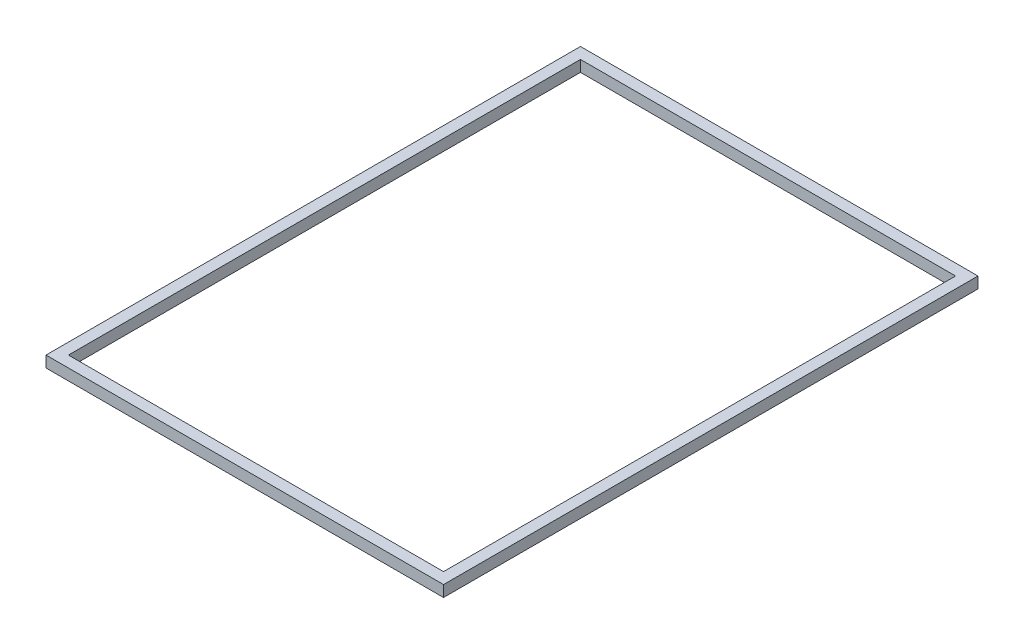
ISO-10303-21;
HEADER;
FILE_DESCRIPTION(('STEP AP214'),'2;1');
FILE_NAME('part.step','',(''),(''),'','','');
FILE_SCHEMA(('AUTOMOTIVE_DESIGN { 1 0 10303 214 1 1 1 1 }'));
ENDSEC;
DATA;
#1=APPLICATION_CONTEXT('core data for automotive mechanical design processes');
#2=APPLICATION_PROTOCOL_DEFINITION('international standard','automotive_design',2000,#1);
#3=PRODUCT_CONTEXT('',#1,'mechanical');
#4=PRODUCT('Part','Part','',(#3));
#5=PRODUCT_RELATED_PRODUCT_CATEGORY('part','',(#4));
#6=PRODUCT_DEFINITION_FORMATION('','',#4);
#7=PRODUCT_DEFINITION_CONTEXT('part definition',#1,'design');
#8=PRODUCT_DEFINITION('design','',#6,#7);
#9=PRODUCT_DEFINITION_SHAPE('','',#8);
#10=(LENGTH_UNIT() NAMED_UNIT(*) SI_UNIT(.MILLI.,.METRE.));
#11=(NAMED_UNIT(*) PLANE_ANGLE_UNIT() SI_UNIT($,.RADIAN.));
#12=(NAMED_UNIT(*) SI_UNIT($,.STERADIAN.) SOLID_ANGLE_UNIT());
#13=UNCERTAINTY_MEASURE_WITH_UNIT(LENGTH_MEASURE(1.E-05),#10,'distance_accuracy_value','');
#14=(GEOMETRIC_REPRESENTATION_CONTEXT(3) GLOBAL_UNCERTAINTY_ASSIGNED_CONTEXT((#13)) GLOBAL_UNIT_ASSIGNED_CONTEXT((#10,
#11,#12)) REPRESENTATION_CONTEXT('',''));
#15=CARTESIAN_POINT('',(0.,0.,0.));
#16=DIRECTION('',(0.,0.,1.));
#17=DIRECTION('',(1.,0.,0.));
#18=AXIS2_PLACEMENT_3D('',#15,#16,#17);
#19=CARTESIAN_POINT('',(-450.,0.,-605.));
#20=DIRECTION('',(-1.,0.,0.));
#21=DIRECTION('',(0.,0.,1.));
#22=AXIS2_PLACEMENT_3D('',#19,#20,#21);
#23=PLANE('',#22);
#24=DIRECTION('',(0.,0.,1.));
#25=VECTOR('',#24,1.);
#26=CARTESIAN_POINT('',(-450.,0.,-605.));
#27=LINE('',#26,#25);
#28=CARTESIAN_POINT('',(-450.,0.,-605.));
#29=VERTEX_POINT('',#28);
#30=CARTESIAN_POINT('',(-450.,0.,605.));
#31=VERTEX_POINT('',#30);
#32=EDGE_CURVE('E130',#29,#31,#27,.T.);
#33=ORIENTED_EDGE('',*,*,#32,.T.);
#34=DIRECTION('',(0.,-1.,0.));
#35=VECTOR('',#34,1.);
#36=CARTESIAN_POINT('',(-450.,0.,605.));
#37=LINE('',#36,#35);
#38=CARTESIAN_POINT('',(-450.,25.4,605.));
#39=VERTEX_POINT('',#38);
#40=EDGE_CURVE('E165',#39,#31,#37,.T.);
#41=ORIENTED_EDGE('',*,*,#40,.F.);
#42=DIRECTION('',(0.,0.,1.));
#43=VECTOR('',#42,1.);
#44=CARTESIAN_POINT('',(-450.,25.4,-605.));
#45=LINE('',#44,#43);
#46=CARTESIAN_POINT('',(-450.,25.4,-605.));
#47=VERTEX_POINT('',#46);
#48=EDGE_CURVE('E145',#47,#39,#45,.T.);
#49=ORIENTED_EDGE('',*,*,#48,.F.);
#50=DIRECTION('',(0.,-1.,0.));
#51=VECTOR('',#50,1.);
#52=CARTESIAN_POINT('',(-450.,0.,-605.));
#53=LINE('',#52,#51);
#54=EDGE_CURVE('E220',#47,#29,#53,.T.);
#55=ORIENTED_EDGE('',*,*,#54,.T.);
#56=EDGE_LOOP('',(#33,#41,#49,#55));
#57=FACE_BOUND('',#56,.T.);
#58=ADVANCED_FACE('F34',(#57),#23,.T.);
#59=CARTESIAN_POINT('',(-424.6,0.,-605.));
#60=DIRECTION('',(1.,0.,0.));
#61=DIRECTION('',(0.,0.,-1.));
#62=AXIS2_PLACEMENT_3D('',#59,#60,#61);
#63=PLANE('',#62);
#64=DIRECTION('',(0.,0.,1.));
#65=VECTOR('',#64,1.);
#66=CARTESIAN_POINT('',(-424.6,25.4,-605.));
#67=LINE('',#66,#65);
#68=CARTESIAN_POINT('',(-424.6,25.4,-579.6));
#69=VERTEX_POINT('',#68);
#70=CARTESIAN_POINT('',(-424.6,25.4,579.6));
#71=VERTEX_POINT('',#70);
#72=EDGE_CURVE('E38',#69,#71,#67,.T.);
#73=ORIENTED_EDGE('',*,*,#72,.T.);
#74=DIRECTION('',(0.,-1.,0.));
#75=VECTOR('',#74,1.);
#76=CARTESIAN_POINT('',(-424.6,0.,579.6));
#77=LINE('',#76,#75);
#78=CARTESIAN_POINT('',(-424.6,0.,579.6));
#79=VERTEX_POINT('',#78);
#80=EDGE_CURVE('E137',#71,#79,#77,.T.);
#81=ORIENTED_EDGE('',*,*,#80,.T.);
#82=DIRECTION('',(0.,0.,1.));
#83=VECTOR('',#82,1.);
#84=CARTESIAN_POINT('',(-424.6,0.,-605.));
#85=LINE('',#84,#83);
#86=CARTESIAN_POINT('',(-424.6,0.,-579.6));
#87=VERTEX_POINT('',#86);
#88=EDGE_CURVE('E146',#87,#79,#85,.T.);
#89=ORIENTED_EDGE('',*,*,#88,.F.);
#90=DIRECTION('',(0.,-1.,0.));
#91=VECTOR('',#90,1.);
#92=CARTESIAN_POINT('',(-424.6,0.,-579.6));
#93=LINE('',#92,#91);
#94=EDGE_CURVE('E140',#69,#87,#93,.T.);
#95=ORIENTED_EDGE('',*,*,#94,.F.);
#96=EDGE_LOOP('',(#73,#81,#89,#95));
#97=FACE_BOUND('',#96,.T.);
#98=ADVANCED_FACE('F136',(#97),#63,.T.);
#99=CARTESIAN_POINT('',(-450.,25.4,-605.));
#100=DIRECTION('',(0.,1.,0.));
#101=DIRECTION('',(0.,0.,1.));
#102=AXIS2_PLACEMENT_3D('',#99,#100,#101);
#103=PLANE('',#102);
#104=DIRECTION('',(1.,0.,0.));
#105=VECTOR('',#104,1.);
#106=CARTESIAN_POINT('',(-450.,25.4,579.6));
#107=LINE('',#106,#105);
#108=CARTESIAN_POINT('',(424.6,25.4,579.6));
#109=VERTEX_POINT('',#108);
#110=EDGE_CURVE('E150',#71,#109,#107,.T.);
#111=ORIENTED_EDGE('',*,*,#110,.F.);
#112=ORIENTED_EDGE('',*,*,#72,.F.);
#113=DIRECTION('',(-1.,0.,0.));
#114=VECTOR('',#113,1.);
#115=CARTESIAN_POINT('',(450.,25.4,-579.6));
#116=LINE('',#115,#114);
#117=CARTESIAN_POINT('',(424.6,25.4,-579.6));
#118=VERTEX_POINT('',#117);
#119=EDGE_CURVE('E179',#118,#69,#116,.T.);
#120=ORIENTED_EDGE('',*,*,#119,.F.);
#121=DIRECTION('',(0.,0.,-1.));
#122=VECTOR('',#121,1.);
#123=CARTESIAN_POINT('',(424.6,25.4,605.));
#124=LINE('',#123,#122);
#125=EDGE_CURVE('E160',#109,#118,#124,.T.);
#126=ORIENTED_EDGE('',*,*,#125,.F.);
#127=EDGE_LOOP('',(#111,#112,#120,#126));
#128=FACE_BOUND('',#127,.T.);
#129=ORIENTED_EDGE('',*,*,#48,.T.);
#130=DIRECTION('',(1.,0.,0.));
#131=VECTOR('',#130,1.);
#132=CARTESIAN_POINT('',(-450.,25.4,605.));
#133=LINE('',#132,#131);
#134=CARTESIAN_POINT('',(450.,25.4,605.));
#135=VERTEX_POINT('',#134);
#136=EDGE_CURVE('E161',#39,#135,#133,.T.);
#137=ORIENTED_EDGE('',*,*,#136,.T.);
#138=DIRECTION('',(0.,0.,-1.));
#139=VECTOR('',#138,1.);
#140=CARTESIAN_POINT('',(450.,25.4,605.));
#141=LINE('',#140,#139);
#142=CARTESIAN_POINT('',(450.,25.4,-605.));
#143=VERTEX_POINT('',#142);
#144=EDGE_CURVE('E203',#135,#143,#141,.T.);
#145=ORIENTED_EDGE('',*,*,#144,.T.);
#146=DIRECTION('',(-1.,0.,0.));
#147=VECTOR('',#146,1.);
#148=CARTESIAN_POINT('',(450.,25.4,-605.));
#149=LINE('',#148,#147);
#150=EDGE_CURVE('E186',#143,#47,#149,.T.);
#151=ORIENTED_EDGE('',*,*,#150,.T.);
#152=EDGE_LOOP('',(#129,#137,#145,#151));
#153=FACE_BOUND('',#152,.T.);
#154=ADVANCED_FACE('F157',(#128,#153),#103,.T.);
#155=CARTESIAN_POINT('',(-450.,0.,-605.));
#156=DIRECTION('',(0.,-1.,0.));
#157=DIRECTION('',(0.,0.,-1.));
#158=AXIS2_PLACEMENT_3D('',#155,#156,#157);
#159=PLANE('',#158);
#160=DIRECTION('',(1.,0.,0.));
#161=VECTOR('',#160,1.);
#162=CARTESIAN_POINT('',(-450.,0.,605.));
#163=LINE('',#162,#161);
#164=CARTESIAN_POINT('',(450.,0.,605.));
#165=VERTEX_POINT('',#164);
#166=EDGE_CURVE('E154',#31,#165,#163,.T.);
#167=ORIENTED_EDGE('',*,*,#166,.F.);
#168=ORIENTED_EDGE('',*,*,#32,.F.);
#169=DIRECTION('',(-1.,0.,0.));
#170=VECTOR('',#169,1.);
#171=CARTESIAN_POINT('',(450.,0.,-605.));
#172=LINE('',#171,#170);
#173=CARTESIAN_POINT('',(450.,0.,-605.));
#174=VERTEX_POINT('',#173);
#175=EDGE_CURVE('E183',#174,#29,#172,.T.);
#176=ORIENTED_EDGE('',*,*,#175,.F.);
#177=DIRECTION('',(0.,0.,-1.));
#178=VECTOR('',#177,1.);
#179=CARTESIAN_POINT('',(450.,0.,605.));
#180=LINE('',#179,#178);
#181=EDGE_CURVE('E201',#165,#174,#180,.T.);
#182=ORIENTED_EDGE('',*,*,#181,.F.);
#183=EDGE_LOOP('',(#167,#168,#176,#182));
#184=FACE_BOUND('',#183,.T.);
#185=ORIENTED_EDGE('',*,*,#88,.T.);
#186=DIRECTION('',(1.,0.,0.));
#187=VECTOR('',#186,1.);
#188=CARTESIAN_POINT('',(-450.,0.,579.6));
#189=LINE('',#188,#187);
#190=CARTESIAN_POINT('',(424.6,0.,579.6));
#191=VERTEX_POINT('',#190);
#192=EDGE_CURVE('E153',#79,#191,#189,.T.);
#193=ORIENTED_EDGE('',*,*,#192,.T.);
#194=DIRECTION('',(0.,0.,-1.));
#195=VECTOR('',#194,1.);
#196=CARTESIAN_POINT('',(424.6,0.,605.));
#197=LINE('',#196,#195);
#198=CARTESIAN_POINT('',(424.6,0.,-579.6));
#199=VERTEX_POINT('',#198);
#200=EDGE_CURVE('E204',#191,#199,#197,.T.);
#201=ORIENTED_EDGE('',*,*,#200,.T.);
#202=DIRECTION('',(-1.,0.,0.));
#203=VECTOR('',#202,1.);
#204=CARTESIAN_POINT('',(450.,0.,-579.6));
#205=LINE('',#204,#203);
#206=EDGE_CURVE('E175',#199,#87,#205,.T.);
#207=ORIENTED_EDGE('',*,*,#206,.T.);
#208=EDGE_LOOP('',(#185,#193,#201,#207));
#209=FACE_BOUND('',#208,.T.);
#210=ADVANCED_FACE('F36',(#184,#209),#159,.T.);
#211=CARTESIAN_POINT('',(-450.,0.,605.));
#212=DIRECTION('',(0.,0.,1.));
#213=DIRECTION('',(1.,0.,0.));
#214=AXIS2_PLACEMENT_3D('',#211,#212,#213);
#215=PLANE('',#214);
#216=ORIENTED_EDGE('',*,*,#166,.T.);
#217=DIRECTION('',(0.,-1.,0.));
#218=VECTOR('',#217,1.);
#219=CARTESIAN_POINT('',(450.,0.,605.));
#220=LINE('',#219,#218);
#221=EDGE_CURVE('E193',#135,#165,#220,.T.);
#222=ORIENTED_EDGE('',*,*,#221,.F.);
#223=ORIENTED_EDGE('',*,*,#136,.F.);
#224=ORIENTED_EDGE('',*,*,#40,.T.);
#225=EDGE_LOOP('',(#216,#222,#223,#224));
#226=FACE_BOUND('',#225,.T.);
#227=ADVANCED_FACE('F191',(#226),#215,.T.);
#228=CARTESIAN_POINT('',(-450.,0.,579.6));
#229=DIRECTION('',(0.,0.,-1.));
#230=DIRECTION('',(-1.,0.,0.));
#231=AXIS2_PLACEMENT_3D('',#228,#229,#230);
#232=PLANE('',#231);
#233=ORIENTED_EDGE('',*,*,#110,.T.);
#234=DIRECTION('',(0.,-1.,0.));
#235=VECTOR('',#234,1.);
#236=CARTESIAN_POINT('',(424.6,0.,579.6));
#237=LINE('',#236,#235);
#238=EDGE_CURVE('E205',#109,#191,#237,.T.);
#239=ORIENTED_EDGE('',*,*,#238,.T.);
#240=ORIENTED_EDGE('',*,*,#192,.F.);
#241=ORIENTED_EDGE('',*,*,#80,.F.);
#242=EDGE_LOOP('',(#233,#239,#240,#241));
#243=FACE_BOUND('',#242,.T.);
#244=ADVANCED_FACE('F149',(#243),#232,.T.);
#245=CARTESIAN_POINT('',(450.,0.,-605.));
#246=DIRECTION('',(0.,0.,-1.));
#247=DIRECTION('',(-1.,0.,0.));
#248=AXIS2_PLACEMENT_3D('',#245,#246,#247);
#249=PLANE('',#248);
#250=ORIENTED_EDGE('',*,*,#175,.T.);
#251=ORIENTED_EDGE('',*,*,#54,.F.);
#252=ORIENTED_EDGE('',*,*,#150,.F.);
#253=DIRECTION('',(0.,-1.,0.));
#254=VECTOR('',#253,1.);
#255=CARTESIAN_POINT('',(450.,0.,-605.));
#256=LINE('',#255,#254);
#257=EDGE_CURVE('E210',#143,#174,#256,.T.);
#258=ORIENTED_EDGE('',*,*,#257,.T.);
#259=EDGE_LOOP('',(#250,#251,#252,#258));
#260=FACE_BOUND('',#259,.T.);
#261=ADVANCED_FACE('F223',(#260),#249,.T.);
#262=CARTESIAN_POINT('',(450.,0.,-579.6));
#263=DIRECTION('',(0.,0.,1.));
#264=DIRECTION('',(1.,0.,0.));
#265=AXIS2_PLACEMENT_3D('',#262,#263,#264);
#266=PLANE('',#265);
#267=ORIENTED_EDGE('',*,*,#119,.T.);
#268=ORIENTED_EDGE('',*,*,#94,.T.);
#269=ORIENTED_EDGE('',*,*,#206,.F.);
#270=DIRECTION('',(0.,-1.,0.));
#271=VECTOR('',#270,1.);
#272=CARTESIAN_POINT('',(424.6,0.,-579.6));
#273=LINE('',#272,#271);
#274=EDGE_CURVE('E209',#118,#199,#273,.T.);
#275=ORIENTED_EDGE('',*,*,#274,.F.);
#276=EDGE_LOOP('',(#267,#268,#269,#275));
#277=FACE_BOUND('',#276,.T.);
#278=ADVANCED_FACE('F177',(#277),#266,.T.);
#279=CARTESIAN_POINT('',(450.,0.,605.));
#280=DIRECTION('',(1.,0.,0.));
#281=DIRECTION('',(0.,0.,-1.));
#282=AXIS2_PLACEMENT_3D('',#279,#280,#281);
#283=PLANE('',#282);
#284=ORIENTED_EDGE('',*,*,#181,.T.);
#285=ORIENTED_EDGE('',*,*,#257,.F.);
#286=ORIENTED_EDGE('',*,*,#144,.F.);
#287=ORIENTED_EDGE('',*,*,#221,.T.);
#288=EDGE_LOOP('',(#284,#285,#286,#287));
#289=FACE_BOUND('',#288,.T.);
#290=ADVANCED_FACE('F199',(#289),#283,.T.);
#291=CARTESIAN_POINT('',(424.6,0.,605.));
#292=DIRECTION('',(-1.,0.,0.));
#293=DIRECTION('',(0.,0.,1.));
#294=AXIS2_PLACEMENT_3D('',#291,#292,#293);
#295=PLANE('',#294);
#296=ORIENTED_EDGE('',*,*,#238,.F.);
#297=ORIENTED_EDGE('',*,*,#125,.T.);
#298=ORIENTED_EDGE('',*,*,#274,.T.);
#299=ORIENTED_EDGE('',*,*,#200,.F.);
#300=EDGE_LOOP('',(#296,#297,#298,#299));
#301=FACE_BOUND('',#300,.T.);
#302=ADVANCED_FACE('F327',(#301),#295,.T.);
#303=CLOSED_SHELL('',(#58,#98,#154,#210,#227,#244,#261,#278,#290,#302));
#304=CARTESIAN_POINT('',(-448.8,1.2,-605.));
#305=DIRECTION('',(1.,0.,0.));
#306=DIRECTION('',(0.,0.,-1.));
#307=AXIS2_PLACEMENT_3D('',#304,#305,#306);
#308=PLANE('',#307);
#309=DIRECTION('',(0.,0.,1.));
#310=VECTOR('',#309,1.);
#311=CARTESIAN_POINT('',(-448.8,24.2,-605.));
#312=LINE('',#311,#310);
#313=CARTESIAN_POINT('',(-448.8,24.2,-603.8));
#314=VERTEX_POINT('',#313);
#315=CARTESIAN_POINT('',(-448.8,24.2,603.8));
#316=VERTEX_POINT('',#315);
#317=EDGE_CURVE('E226',#314,#316,#312,.T.);
#318=ORIENTED_EDGE('',*,*,#317,.T.);
#319=DIRECTION('',(0.,-1.,0.));
#320=VECTOR('',#319,1.);
#321=CARTESIAN_POINT('',(-448.8,1.2,603.8));
#322=LINE('',#321,#320);
#323=CARTESIAN_POINT('',(-448.8,1.2,603.8));
#324=VERTEX_POINT('',#323);
#325=EDGE_CURVE('E228',#316,#324,#322,.T.);
#326=ORIENTED_EDGE('',*,*,#325,.T.);
#327=DIRECTION('',(0.,0.,1.));
#328=VECTOR('',#327,1.);
#329=CARTESIAN_POINT('',(-448.8,1.2,-605.));
#330=LINE('',#329,#328);
#331=CARTESIAN_POINT('',(-448.8,1.2,-603.8));
#332=VERTEX_POINT('',#331);
#333=EDGE_CURVE('E212',#332,#324,#330,.T.);
#334=ORIENTED_EDGE('',*,*,#333,.F.);
#335=DIRECTION('',(0.,-1.,0.));
#336=VECTOR('',#335,1.);
#337=CARTESIAN_POINT('',(-448.8,1.2,-603.8));
#338=LINE('',#337,#336);
#339=EDGE_CURVE('E255',#314,#332,#338,.T.);
#340=ORIENTED_EDGE('',*,*,#339,.F.);
#341=EDGE_LOOP('',(#318,#326,#334,#340));
#342=FACE_BOUND('',#341,.T.);
#343=ADVANCED_FACE('F311',(#342),#308,.T.);
#344=CARTESIAN_POINT('',(-425.8,1.2,-605.));
#345=DIRECTION('',(-1.,0.,0.));
#346=DIRECTION('',(0.,0.,1.));
#347=AXIS2_PLACEMENT_3D('',#344,#345,#346);
#348=PLANE('',#347);
#349=DIRECTION('',(0.,0.,1.));
#350=VECTOR('',#349,1.);
#351=CARTESIAN_POINT('',(-425.8,1.2,-605.));
#352=LINE('',#351,#350);
#353=CARTESIAN_POINT('',(-425.8,1.2,-580.8));
#354=VERTEX_POINT('',#353);
#355=CARTESIAN_POINT('',(-425.8,1.2,580.8));
#356=VERTEX_POINT('',#355);
#357=EDGE_CURVE('E231',#354,#356,#352,.T.);
#358=ORIENTED_EDGE('',*,*,#357,.T.);
#359=DIRECTION('',(0.,1.,0.));
#360=VECTOR('',#359,1.);
#361=CARTESIAN_POINT('',(-425.8,1.2,580.8));
#362=LINE('',#361,#360);
#363=CARTESIAN_POINT('',(-425.8,24.2,580.8));
#364=VERTEX_POINT('',#363);
#365=EDGE_CURVE('E247',#356,#364,#362,.T.);
#366=ORIENTED_EDGE('',*,*,#365,.T.);
#367=DIRECTION('',(0.,0.,1.));
#368=VECTOR('',#367,1.);
#369=CARTESIAN_POINT('',(-425.8,24.2,-605.));
#370=LINE('',#369,#368);
#371=CARTESIAN_POINT('',(-425.8,24.2,-580.8));
#372=VERTEX_POINT('',#371);
#373=EDGE_CURVE('E229',#372,#364,#370,.T.);
#374=ORIENTED_EDGE('',*,*,#373,.F.);
#375=DIRECTION('',(0.,1.,0.));
#376=VECTOR('',#375,1.);
#377=CARTESIAN_POINT('',(-425.8,1.2,-580.8));
#378=LINE('',#377,#376);
#379=EDGE_CURVE('E264',#354,#372,#378,.T.);
#380=ORIENTED_EDGE('',*,*,#379,.F.);
#381=EDGE_LOOP('',(#358,#366,#374,#380));
#382=FACE_BOUND('',#381,.T.);
#383=ADVANCED_FACE('F313',(#382),#348,.T.);
#384=CARTESIAN_POINT('',(-450.,1.2,603.8));
#385=DIRECTION('',(0.,0.,-1.));
#386=DIRECTION('',(-1.,0.,0.));
#387=AXIS2_PLACEMENT_3D('',#384,#385,#386);
#388=PLANE('',#387);
#389=DIRECTION('',(1.,0.,0.));
#390=VECTOR('',#389,1.);
#391=CARTESIAN_POINT('',(-450.,24.2,603.8));
#392=LINE('',#391,#390);
#393=CARTESIAN_POINT('',(448.8,24.2,603.8));
#394=VERTEX_POINT('',#393);
#395=EDGE_CURVE('E234',#316,#394,#392,.T.);
#396=ORIENTED_EDGE('',*,*,#395,.T.);
#397=DIRECTION('',(0.,-1.,0.));
#398=VECTOR('',#397,1.);
#399=CARTESIAN_POINT('',(448.8,1.2,603.8));
#400=LINE('',#399,#398);
#401=CARTESIAN_POINT('',(448.8,1.2,603.8));
#402=VERTEX_POINT('',#401);
#403=EDGE_CURVE('E265',#394,#402,#400,.T.);
#404=ORIENTED_EDGE('',*,*,#403,.T.);
#405=DIRECTION('',(1.,0.,0.));
#406=VECTOR('',#405,1.);
#407=CARTESIAN_POINT('',(-450.,1.2,603.8));
#408=LINE('',#407,#406);
#409=EDGE_CURVE('E244',#324,#402,#408,.T.);
#410=ORIENTED_EDGE('',*,*,#409,.F.);
#411=ORIENTED_EDGE('',*,*,#325,.F.);
#412=EDGE_LOOP('',(#396,#404,#410,#411));
#413=FACE_BOUND('',#412,.T.);
#414=ADVANCED_FACE('F301',(#413),#388,.T.);
#415=CARTESIAN_POINT('',(-450.,1.2,580.8));
#416=DIRECTION('',(0.,0.,1.));
#417=DIRECTION('',(1.,0.,0.));
#418=AXIS2_PLACEMENT_3D('',#415,#416,#417);
#419=PLANE('',#418);
#420=DIRECTION('',(1.,0.,0.));
#421=VECTOR('',#420,1.);
#422=CARTESIAN_POINT('',(-450.,1.2,580.8));
#423=LINE('',#422,#421);
#424=CARTESIAN_POINT('',(425.8,1.2,580.8));
#425=VERTEX_POINT('',#424);
#426=EDGE_CURVE('E241',#356,#425,#423,.T.);
#427=ORIENTED_EDGE('',*,*,#426,.T.);
#428=DIRECTION('',(0.,1.,0.));
#429=VECTOR('',#428,1.);
#430=CARTESIAN_POINT('',(425.8,1.2,580.8));
#431=LINE('',#430,#429);
#432=CARTESIAN_POINT('',(425.8,24.2,580.8));
#433=VERTEX_POINT('',#432);
#434=EDGE_CURVE('E278',#425,#433,#431,.T.);
#435=ORIENTED_EDGE('',*,*,#434,.T.);
#436=DIRECTION('',(1.,0.,0.));
#437=VECTOR('',#436,1.);
#438=CARTESIAN_POINT('',(-450.,24.2,580.8));
#439=LINE('',#438,#437);
#440=EDGE_CURVE('E238',#364,#433,#439,.T.);
#441=ORIENTED_EDGE('',*,*,#440,.F.);
#442=ORIENTED_EDGE('',*,*,#365,.F.);
#443=EDGE_LOOP('',(#427,#435,#441,#442));
#444=FACE_BOUND('',#443,.T.);
#445=ADVANCED_FACE('F390',(#444),#419,.T.);
#446=CARTESIAN_POINT('',(450.,1.2,-603.8));
#447=DIRECTION('',(0.,0.,1.));
#448=DIRECTION('',(1.,0.,0.));
#449=AXIS2_PLACEMENT_3D('',#446,#447,#448);
#450=PLANE('',#449);
#451=DIRECTION('',(-1.,0.,0.));
#452=VECTOR('',#451,1.);
#453=CARTESIAN_POINT('',(450.,24.2,-603.8));
#454=LINE('',#453,#452);
#455=CARTESIAN_POINT('',(448.8,24.2,-603.8));
#456=VERTEX_POINT('',#455);
#457=EDGE_CURVE('E252',#456,#314,#454,.T.);
#458=ORIENTED_EDGE('',*,*,#457,.T.);
#459=ORIENTED_EDGE('',*,*,#339,.T.);
#460=DIRECTION('',(-1.,0.,0.));
#461=VECTOR('',#460,1.);
#462=CARTESIAN_POINT('',(450.,1.2,-603.8));
#463=LINE('',#462,#461);
#464=CARTESIAN_POINT('',(448.8,1.2,-603.8));
#465=VERTEX_POINT('',#464);
#466=EDGE_CURVE('E237',#465,#332,#463,.T.);
#467=ORIENTED_EDGE('',*,*,#466,.F.);
#468=DIRECTION('',(0.,-1.,0.));
#469=VECTOR('',#468,1.);
#470=CARTESIAN_POINT('',(448.8,1.2,-603.8));
#471=LINE('',#470,#469);
#472=EDGE_CURVE('E275',#456,#465,#471,.T.);
#473=ORIENTED_EDGE('',*,*,#472,.F.);
#474=EDGE_LOOP('',(#458,#459,#467,#473));
#475=FACE_BOUND('',#474,.T.);
#476=ADVANCED_FACE('F309',(#475),#450,.T.);
#477=CARTESIAN_POINT('',(450.,1.2,-580.8));
#478=DIRECTION('',(0.,0.,-1.));
#479=DIRECTION('',(-1.,0.,0.));
#480=AXIS2_PLACEMENT_3D('',#477,#478,#479);
#481=PLANE('',#480);
#482=DIRECTION('',(-1.,0.,0.));
#483=VECTOR('',#482,1.);
#484=CARTESIAN_POINT('',(450.,1.2,-580.8));
#485=LINE('',#484,#483);
#486=CARTESIAN_POINT('',(425.8,1.2,-580.8));
#487=VERTEX_POINT('',#486);
#488=EDGE_CURVE('E257',#487,#354,#485,.T.);
#489=ORIENTED_EDGE('',*,*,#488,.T.);
#490=ORIENTED_EDGE('',*,*,#379,.T.);
#491=DIRECTION('',(-1.,0.,0.));
#492=VECTOR('',#491,1.);
#493=CARTESIAN_POINT('',(450.,24.2,-580.8));
#494=LINE('',#493,#492);
#495=CARTESIAN_POINT('',(425.8,24.2,-580.8));
#496=VERTEX_POINT('',#495);
#497=EDGE_CURVE('E53',#496,#372,#494,.T.);
#498=ORIENTED_EDGE('',*,*,#497,.F.);
#499=DIRECTION('',(0.,1.,0.));
#500=VECTOR('',#499,1.);
#501=CARTESIAN_POINT('',(425.8,1.2,-580.8));
#502=LINE('',#501,#500);
#503=EDGE_CURVE('E281',#487,#496,#502,.T.);
#504=ORIENTED_EDGE('',*,*,#503,.F.);
#505=EDGE_LOOP('',(#489,#490,#498,#504));
#506=FACE_BOUND('',#505,.T.);
#507=ADVANCED_FACE('F407',(#506),#481,.T.);
#508=CARTESIAN_POINT('',(448.8,1.2,605.));
#509=DIRECTION('',(-1.,0.,0.));
#510=DIRECTION('',(0.,0.,1.));
#511=AXIS2_PLACEMENT_3D('',#508,#509,#510);
#512=PLANE('',#511);
#513=ORIENTED_EDGE('',*,*,#403,.F.);
#514=DIRECTION('',(0.,0.,-1.));
#515=VECTOR('',#514,1.);
#516=CARTESIAN_POINT('',(448.8,24.2,605.));
#517=LINE('',#516,#515);
#518=EDGE_CURVE('E11',#394,#456,#517,.T.);
#519=ORIENTED_EDGE('',*,*,#518,.T.);
#520=ORIENTED_EDGE('',*,*,#472,.T.);
#521=DIRECTION('',(0.,0.,-1.));
#522=VECTOR('',#521,1.);
#523=CARTESIAN_POINT('',(448.8,1.2,605.));
#524=LINE('',#523,#522);
#525=EDGE_CURVE('E272',#402,#465,#524,.T.);
#526=ORIENTED_EDGE('',*,*,#525,.F.);
#527=EDGE_LOOP('',(#513,#519,#520,#526));
#528=FACE_BOUND('',#527,.T.);
#529=ADVANCED_FACE('F288',(#528),#512,.T.);
#530=CARTESIAN_POINT('',(448.8,1.2,605.));
#531=DIRECTION('',(0.,1.,0.));
#532=DIRECTION('',(0.,0.,1.));
#533=AXIS2_PLACEMENT_3D('',#530,#531,#532);
#534=PLANE('',#533);
#535=ORIENTED_EDGE('',*,*,#426,.F.);
#536=ORIENTED_EDGE('',*,*,#357,.F.);
#537=ORIENTED_EDGE('',*,*,#488,.F.);
#538=DIRECTION('',(0.,0.,-1.));
#539=VECTOR('',#538,1.);
#540=CARTESIAN_POINT('',(425.8,1.2,605.));
#541=LINE('',#540,#539);
#542=EDGE_CURVE('E269',#425,#487,#541,.T.);
#543=ORIENTED_EDGE('',*,*,#542,.F.);
#544=EDGE_LOOP('',(#535,#536,#537,#543));
#545=FACE_BOUND('',#544,.T.);
#546=ORIENTED_EDGE('',*,*,#333,.T.);
#547=ORIENTED_EDGE('',*,*,#409,.T.);
#548=ORIENTED_EDGE('',*,*,#525,.T.);
#549=ORIENTED_EDGE('',*,*,#466,.T.);
#550=EDGE_LOOP('',(#546,#547,#548,#549));
#551=FACE_BOUND('',#550,.T.);
#552=ADVANCED_FACE('F295',(#545,#551),#534,.T.);
#553=CARTESIAN_POINT('',(425.8,1.2,605.));
#554=DIRECTION('',(1.,0.,0.));
#555=DIRECTION('',(0.,0.,-1.));
#556=AXIS2_PLACEMENT_3D('',#553,#554,#555);
#557=PLANE('',#556);
#558=ORIENTED_EDGE('',*,*,#434,.F.);
#559=ORIENTED_EDGE('',*,*,#542,.T.);
#560=ORIENTED_EDGE('',*,*,#503,.T.);
#561=DIRECTION('',(0.,0.,-1.));
#562=VECTOR('',#561,1.);
#563=CARTESIAN_POINT('',(425.8,24.2,605.));
#564=LINE('',#563,#562);
#565=EDGE_CURVE('E44',#433,#496,#564,.T.);
#566=ORIENTED_EDGE('',*,*,#565,.F.);
#567=EDGE_LOOP('',(#558,#559,#560,#566));
#568=FACE_BOUND('',#567,.T.);
#569=ADVANCED_FACE('F433',(#568),#557,.T.);
#570=CARTESIAN_POINT('',(448.8,24.2,605.));
#571=DIRECTION('',(0.,-1.,0.));
#572=DIRECTION('',(0.,0.,-1.));
#573=AXIS2_PLACEMENT_3D('',#570,#571,#572);
#574=PLANE('',#573);
#575=ORIENTED_EDGE('',*,*,#395,.F.);
#576=ORIENTED_EDGE('',*,*,#317,.F.);
#577=ORIENTED_EDGE('',*,*,#457,.F.);
#578=ORIENTED_EDGE('',*,*,#518,.F.);
#579=EDGE_LOOP('',(#575,#576,#577,#578));
#580=FACE_BOUND('',#579,.T.);
#581=ORIENTED_EDGE('',*,*,#373,.T.);
#582=ORIENTED_EDGE('',*,*,#440,.T.);
#583=ORIENTED_EDGE('',*,*,#565,.T.);
#584=ORIENTED_EDGE('',*,*,#497,.T.);
#585=EDGE_LOOP('',(#581,#582,#583,#584));
#586=FACE_BOUND('',#585,.T.);
#587=ADVANCED_FACE('F306',(#580,#586),#574,.T.);
#588=CLOSED_SHELL('',(#343,#383,#414,#445,#476,#507,#529,#552,#569,#587));
#589=ORIENTED_CLOSED_SHELL('',*,#588,.T.);
#590=BREP_WITH_VOIDS('B2',#303,(#589));
#591=ADVANCED_BREP_SHAPE_REPRESENTATION('',(#18,#590),#14);
#592=SHAPE_DEFINITION_REPRESENTATION(#9,#591);
ENDSEC;
END-ISO-10303-21;
